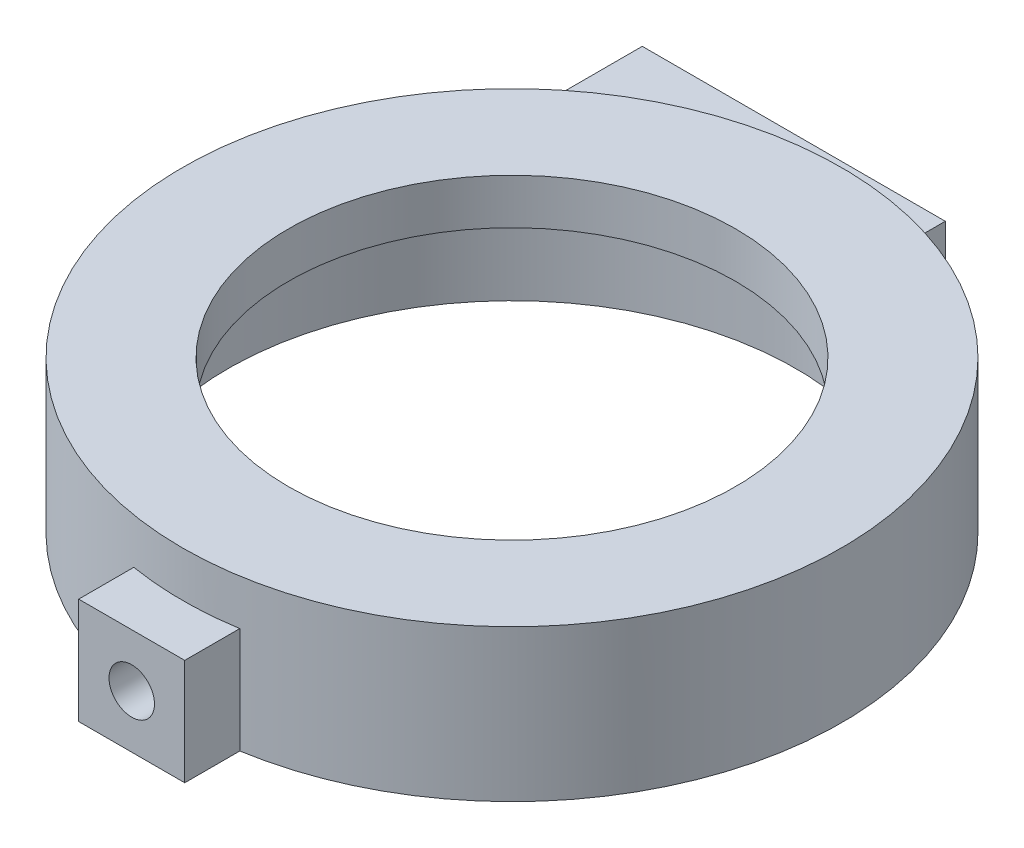
ISO-10303-21;
HEADER;
FILE_DESCRIPTION(('STEP AP214'),'2;1');
FILE_NAME('part.step','',(''),(''),'','','');
FILE_SCHEMA(('AUTOMOTIVE_DESIGN { 1 0 10303 214 1 1 1 1 }'));
ENDSEC;
DATA;
#1=APPLICATION_CONTEXT('core data for automotive mechanical design processes');
#2=APPLICATION_PROTOCOL_DEFINITION('international standard','automotive_design',2000,#1);
#3=PRODUCT_CONTEXT('',#1,'mechanical');
#4=PRODUCT('Part','Part','',(#3));
#5=PRODUCT_RELATED_PRODUCT_CATEGORY('part','',(#4));
#6=PRODUCT_DEFINITION_FORMATION('','',#4);
#7=PRODUCT_DEFINITION_CONTEXT('part definition',#1,'design');
#8=PRODUCT_DEFINITION('design','',#6,#7);
#9=PRODUCT_DEFINITION_SHAPE('','',#8);
#10=(LENGTH_UNIT() NAMED_UNIT(*) SI_UNIT(.MILLI.,.METRE.));
#11=(NAMED_UNIT(*) PLANE_ANGLE_UNIT() SI_UNIT($,.RADIAN.));
#12=(NAMED_UNIT(*) SI_UNIT($,.STERADIAN.) SOLID_ANGLE_UNIT());
#13=UNCERTAINTY_MEASURE_WITH_UNIT(LENGTH_MEASURE(1.E-05),#10,'distance_accuracy_value','');
#14=(GEOMETRIC_REPRESENTATION_CONTEXT(3) GLOBAL_UNCERTAINTY_ASSIGNED_CONTEXT((#13)) GLOBAL_UNIT_ASSIGNED_CONTEXT((#10,
#11,#12)) REPRESENTATION_CONTEXT('',''));
#15=CARTESIAN_POINT('',(0.,0.,0.));
#16=DIRECTION('',(0.,0.,1.));
#17=DIRECTION('',(1.,0.,0.));
#18=AXIS2_PLACEMENT_3D('',#15,#16,#17);
#19=CARTESIAN_POINT('',(0.,7.,0.));
#20=DIRECTION('',(0.,1.,0.));
#21=DIRECTION('',(0.,0.,1.));
#22=AXIS2_PLACEMENT_3D('',#19,#20,#21);
#23=PLANE('',#22);
#24=CARTESIAN_POINT('',(0.,7.,0.));
#25=DIRECTION('',(0.,1.,0.));
#26=DIRECTION('',(0.,0.,1.));
#27=AXIS2_PLACEMENT_3D('',#24,#25,#26);
#28=CIRCLE('',#27,21.75);
#29=CARTESIAN_POINT('',(3.5,7.,-21.4665437367081));
#30=VERTEX_POINT('',#29);
#31=CARTESIAN_POINT('',(-16.5,7.,-14.1708327207684));
#32=VERTEX_POINT('',#31);
#33=EDGE_CURVE('E12',#30,#32,#28,.T.);
#34=ORIENTED_EDGE('',*,*,#33,.F.);
#35=DIRECTION('',(0.,0.,1.));
#36=VECTOR('',#35,1.);
#37=CARTESIAN_POINT('',(3.5,7.,-25.1));
#38=LINE('',#37,#36);
#39=CARTESIAN_POINT('',(3.5,7.,-25.1));
#40=VERTEX_POINT('',#39);
#41=EDGE_CURVE('E184',#40,#30,#38,.T.);
#42=ORIENTED_EDGE('',*,*,#41,.F.);
#43=DIRECTION('',(-1.,0.,0.));
#44=VECTOR('',#43,1.);
#45=CARTESIAN_POINT('',(3.5,7.,-25.1));
#46=LINE('',#45,#44);
#47=CARTESIAN_POINT('',(-16.5,7.,-25.1));
#48=VERTEX_POINT('',#47);
#49=EDGE_CURVE('E178',#40,#48,#46,.T.);
#50=ORIENTED_EDGE('',*,*,#49,.T.);
#51=DIRECTION('',(0.,0.,-1.));
#52=VECTOR('',#51,1.);
#53=CARTESIAN_POINT('',(-16.5,7.,-25.1));
#54=LINE('',#53,#52);
#55=EDGE_CURVE('E233',#32,#48,#54,.T.);
#56=ORIENTED_EDGE('',*,*,#55,.F.);
#57=EDGE_LOOP('',(#34,#42,#50,#56));
#58=FACE_BOUND('',#57,.T.);
#59=ADVANCED_FACE('F76',(#58),#23,.T.);
#60=CARTESIAN_POINT('',(-3.5,7.,21.4665437367081));
#61=VERTEX_POINT('',#60);
#62=CARTESIAN_POINT('',(3.5,7.,21.4665437367081));
#63=VERTEX_POINT('',#62);
#64=EDGE_CURVE('E91',#61,#63,#28,.T.);
#65=ORIENTED_EDGE('',*,*,#64,.F.);
#66=DIRECTION('',(0.,0.,-1.));
#67=VECTOR('',#66,1.);
#68=CARTESIAN_POINT('',(-3.5,7.,25.1));
#69=LINE('',#68,#67);
#70=CARTESIAN_POINT('',(-3.5,7.,25.1));
#71=VERTEX_POINT('',#70);
#72=EDGE_CURVE('E155',#71,#61,#69,.T.);
#73=ORIENTED_EDGE('',*,*,#72,.F.);
#74=DIRECTION('',(-1.,0.,0.));
#75=VECTOR('',#74,1.);
#76=CARTESIAN_POINT('',(3.5,7.,25.1));
#77=LINE('',#76,#75);
#78=CARTESIAN_POINT('',(3.5,7.,25.1));
#79=VERTEX_POINT('',#78);
#80=EDGE_CURVE('E177',#79,#71,#77,.T.);
#81=ORIENTED_EDGE('',*,*,#80,.F.);
#82=DIRECTION('',(0.,0.,-1.));
#83=VECTOR('',#82,1.);
#84=CARTESIAN_POINT('',(3.5,7.,25.1));
#85=LINE('',#84,#83);
#86=EDGE_CURVE('E157',#79,#63,#85,.T.);
#87=ORIENTED_EDGE('',*,*,#86,.T.);
#88=EDGE_LOOP('',(#65,#73,#81,#87));
#89=FACE_BOUND('',#88,.T.);
#90=ADVANCED_FACE('F152',(#89),#23,.T.);
#91=CARTESIAN_POINT('',(0.,0.,0.));
#92=DIRECTION('',(0.,1.,0.));
#93=DIRECTION('',(0.,0.,1.));
#94=AXIS2_PLACEMENT_3D('',#91,#92,#93);
#95=PLANE('',#94);
#96=DIRECTION('',(0.,0.,-1.));
#97=VECTOR('',#96,1.);
#98=CARTESIAN_POINT('',(3.5,0.,25.1));
#99=LINE('',#98,#97);
#100=CARTESIAN_POINT('',(3.5,0.,25.1));
#101=VERTEX_POINT('',#100);
#102=CARTESIAN_POINT('',(3.5,0.,21.4665437367081));
#103=VERTEX_POINT('',#102);
#104=EDGE_CURVE('E188',#101,#103,#99,.T.);
#105=ORIENTED_EDGE('',*,*,#104,.F.);
#106=DIRECTION('',(-1.,0.,0.));
#107=VECTOR('',#106,1.);
#108=CARTESIAN_POINT('',(3.5,0.,25.1));
#109=LINE('',#108,#107);
#110=CARTESIAN_POINT('',(-3.5,0.,25.1));
#111=VERTEX_POINT('',#110);
#112=EDGE_CURVE('E209',#101,#111,#109,.T.);
#113=ORIENTED_EDGE('',*,*,#112,.T.);
#114=DIRECTION('',(0.,0.,-1.));
#115=VECTOR('',#114,1.);
#116=CARTESIAN_POINT('',(-3.5,0.,25.1));
#117=LINE('',#116,#115);
#118=CARTESIAN_POINT('',(-3.5,0.,21.4665437367081));
#119=VERTEX_POINT('',#118);
#120=EDGE_CURVE('E206',#111,#119,#117,.T.);
#121=ORIENTED_EDGE('',*,*,#120,.T.);
#122=CARTESIAN_POINT('',(0.,0.,0.));
#123=DIRECTION('',(0.,1.,0.));
#124=DIRECTION('',(0.,0.,1.));
#125=AXIS2_PLACEMENT_3D('',#122,#123,#124);
#126=CIRCLE('',#125,21.75);
#127=CARTESIAN_POINT('',(-16.5,0.,-14.1708327207684));
#128=VERTEX_POINT('',#127);
#129=EDGE_CURVE('E167',#128,#119,#126,.T.);
#130=ORIENTED_EDGE('',*,*,#129,.F.);
#131=DIRECTION('',(0.,0.,-1.));
#132=VECTOR('',#131,1.);
#133=CARTESIAN_POINT('',(-16.5,0.,-25.1));
#134=LINE('',#133,#132);
#135=CARTESIAN_POINT('',(-16.5,0.,-25.1));
#136=VERTEX_POINT('',#135);
#137=EDGE_CURVE('E230',#128,#136,#134,.T.);
#138=ORIENTED_EDGE('',*,*,#137,.T.);
#139=DIRECTION('',(-1.,0.,0.));
#140=VECTOR('',#139,1.);
#141=CARTESIAN_POINT('',(3.5,0.,-25.1));
#142=LINE('',#141,#140);
#143=CARTESIAN_POINT('',(3.5,0.,-25.1));
#144=VERTEX_POINT('',#143);
#145=EDGE_CURVE('E200',#144,#136,#142,.T.);
#146=ORIENTED_EDGE('',*,*,#145,.F.);
#147=DIRECTION('',(0.,0.,1.));
#148=VECTOR('',#147,1.);
#149=CARTESIAN_POINT('',(3.5,0.,-25.1));
#150=LINE('',#149,#148);
#151=CARTESIAN_POINT('',(3.5,0.,-21.4665437367081));
#152=VERTEX_POINT('',#151);
#153=EDGE_CURVE('E196',#144,#152,#150,.T.);
#154=ORIENTED_EDGE('',*,*,#153,.T.);
#155=CARTESIAN_POINT('',(0.,0.,0.));
#156=DIRECTION('',(0.,1.,0.));
#157=DIRECTION('',(0.,0.,1.));
#158=AXIS2_PLACEMENT_3D('',#155,#156,#157);
#159=CIRCLE('',#158,21.75);
#160=EDGE_CURVE('E191',#103,#152,#159,.T.);
#161=ORIENTED_EDGE('',*,*,#160,.F.);
#162=EDGE_LOOP('',(#105,#113,#121,#130,#138,#146,#154,#161));
#163=FACE_BOUND('',#162,.T.);
#164=CARTESIAN_POINT('',(0.,0.,0.));
#165=DIRECTION('',(0.,1.,0.));
#166=DIRECTION('',(0.,0.,1.));
#167=AXIS2_PLACEMENT_3D('',#164,#165,#166);
#168=CIRCLE('',#167,18.75);
#169=CARTESIAN_POINT('',(0.,0.,18.75));
#170=VERTEX_POINT('',#169);
#171=EDGE_CURVE('E192',#170,#170,#168,.T.);
#172=ORIENTED_EDGE('',*,*,#171,.T.);
#173=EDGE_LOOP('',(#172));
#174=FACE_BOUND('',#173,.T.);
#175=ADVANCED_FACE('F224',(#163,#174),#95,.F.);
#176=CARTESIAN_POINT('',(3.5,7.,25.1));
#177=DIRECTION('',(-1.,0.,0.));
#178=DIRECTION('',(0.,0.,1.));
#179=AXIS2_PLACEMENT_3D('',#176,#177,#178);
#180=PLANE('',#179);
#181=ORIENTED_EDGE('',*,*,#104,.T.);
#182=DIRECTION('',(0.,-1.,0.));
#183=VECTOR('',#182,1.);
#184=CARTESIAN_POINT('',(3.5,7.,21.4665437367081));
#185=LINE('',#184,#183);
#186=EDGE_CURVE('E161',#63,#103,#185,.T.);
#187=ORIENTED_EDGE('',*,*,#186,.F.);
#188=ORIENTED_EDGE('',*,*,#86,.F.);
#189=DIRECTION('',(0.,-1.,0.));
#190=VECTOR('',#189,1.);
#191=CARTESIAN_POINT('',(3.5,7.,25.1));
#192=LINE('',#191,#190);
#193=EDGE_CURVE('E108',#79,#101,#192,.T.);
#194=ORIENTED_EDGE('',*,*,#193,.T.);
#195=EDGE_LOOP('',(#181,#187,#188,#194));
#196=FACE_BOUND('',#195,.T.);
#197=ADVANCED_FACE('F78',(#196),#180,.F.);
#198=CARTESIAN_POINT('',(3.5,7.,-25.1));
#199=DIRECTION('',(1.,0.,0.));
#200=DIRECTION('',(0.,0.,-1.));
#201=AXIS2_PLACEMENT_3D('',#198,#199,#200);
#202=PLANE('',#201);
#203=ORIENTED_EDGE('',*,*,#153,.F.);
#204=DIRECTION('',(0.,-1.,0.));
#205=VECTOR('',#204,1.);
#206=CARTESIAN_POINT('',(3.5,7.,-25.1));
#207=LINE('',#206,#205);
#208=EDGE_CURVE('E172',#40,#144,#207,.T.);
#209=ORIENTED_EDGE('',*,*,#208,.F.);
#210=ORIENTED_EDGE('',*,*,#41,.T.);
#211=DIRECTION('',(0.,-1.,0.));
#212=VECTOR('',#211,1.);
#213=CARTESIAN_POINT('',(3.5,7.,-21.4665437367081));
#214=LINE('',#213,#212);
#215=EDGE_CURVE('E219',#30,#152,#214,.T.);
#216=ORIENTED_EDGE('',*,*,#215,.T.);
#217=EDGE_LOOP('',(#203,#209,#210,#216));
#218=FACE_BOUND('',#217,.T.);
#219=ADVANCED_FACE('F276',(#218),#202,.T.);
#220=CARTESIAN_POINT('',(3.5,7.,-25.1));
#221=DIRECTION('',(0.,0.,1.));
#222=DIRECTION('',(1.,0.,0.));
#223=AXIS2_PLACEMENT_3D('',#220,#221,#222);
#224=PLANE('',#223);
#225=CARTESIAN_POINT('',(-10.,3.5,-25.1));
#226=DIRECTION('',(0.,0.,-1.));
#227=DIRECTION('',(-1.,0.,0.));
#228=AXIS2_PLACEMENT_3D('',#225,#226,#227);
#229=CIRCLE('',#228,1.4);
#230=CARTESIAN_POINT('',(-11.4,3.5,-25.1));
#231=VERTEX_POINT('',#230);
#232=EDGE_CURVE('E245',#231,#231,#229,.T.);
#233=ORIENTED_EDGE('',*,*,#232,.F.);
#234=EDGE_LOOP('',(#233));
#235=FACE_BOUND('',#234,.T.);
#236=CARTESIAN_POINT('',(0.,3.5,-25.1));
#237=DIRECTION('',(0.,0.,-1.));
#238=DIRECTION('',(-1.,0.,0.));
#239=AXIS2_PLACEMENT_3D('',#236,#237,#238);
#240=CIRCLE('',#239,1.4);
#241=CARTESIAN_POINT('',(-1.40000000000001,3.5,-25.1));
#242=VERTEX_POINT('',#241);
#243=EDGE_CURVE('E250',#242,#242,#240,.T.);
#244=ORIENTED_EDGE('',*,*,#243,.F.);
#245=EDGE_LOOP('',(#244));
#246=FACE_BOUND('',#245,.T.);
#247=ORIENTED_EDGE('',*,*,#145,.T.);
#248=DIRECTION('',(0.,-1.,0.));
#249=VECTOR('',#248,1.);
#250=CARTESIAN_POINT('',(-16.5,7.,-25.1));
#251=LINE('',#250,#249);
#252=EDGE_CURVE('E232',#48,#136,#251,.T.);
#253=ORIENTED_EDGE('',*,*,#252,.F.);
#254=ORIENTED_EDGE('',*,*,#49,.F.);
#255=ORIENTED_EDGE('',*,*,#208,.T.);
#256=EDGE_LOOP('',(#247,#253,#254,#255));
#257=FACE_BOUND('',#256,.T.);
#258=ADVANCED_FACE('F280',(#235,#246,#257),#224,.F.);
#259=CARTESIAN_POINT('',(0.,7.,0.));
#260=DIRECTION('',(0.,-1.,0.));
#261=DIRECTION('',(0.,0.,-1.));
#262=AXIS2_PLACEMENT_3D('',#259,#260,#261);
#263=CYLINDRICAL_SURFACE('',#262,21.75);
#264=DIRECTION('',(0.,-1.,0.));
#265=VECTOR('',#264,1.);
#266=CARTESIAN_POINT('',(-3.5,7.,21.4665437367081));
#267=LINE('',#266,#265);
#268=EDGE_CURVE('E163',#61,#119,#267,.T.);
#269=ORIENTED_EDGE('',*,*,#268,.F.);
#270=ORIENTED_EDGE('',*,*,#64,.T.);
#271=ORIENTED_EDGE('',*,*,#186,.T.);
#272=ORIENTED_EDGE('',*,*,#160,.T.);
#273=ORIENTED_EDGE('',*,*,#215,.F.);
#274=ORIENTED_EDGE('',*,*,#33,.T.);
#275=DIRECTION('',(0.,-1.,0.));
#276=VECTOR('',#275,1.);
#277=CARTESIAN_POINT('',(-16.5,7.,-14.1708327207684));
#278=LINE('',#277,#276);
#279=EDGE_CURVE('E99',#32,#128,#278,.T.);
#280=ORIENTED_EDGE('',*,*,#279,.T.);
#281=ORIENTED_EDGE('',*,*,#129,.T.);
#282=EDGE_LOOP('',(#269,#270,#271,#272,#273,#274,#280,#281));
#283=FACE_BOUND('',#282,.T.);
#284=CARTESIAN_POINT('',(0.,10.,0.));
#285=DIRECTION('',(0.,1.,0.));
#286=DIRECTION('',(0.,0.,1.));
#287=AXIS2_PLACEMENT_3D('',#284,#285,#286);
#288=CIRCLE('',#287,21.75);
#289=CARTESIAN_POINT('',(0.,10.,21.75));
#290=VERTEX_POINT('',#289);
#291=EDGE_CURVE('E267',#290,#290,#288,.T.);
#292=ORIENTED_EDGE('',*,*,#291,.F.);
#293=EDGE_LOOP('',(#292));
#294=FACE_BOUND('',#293,.T.);
#295=ADVANCED_FACE('F164',(#283,#294),#263,.T.);
#296=CARTESIAN_POINT('',(-3.5,7.,25.1));
#297=DIRECTION('',(-1.,0.,0.));
#298=DIRECTION('',(0.,0.,1.));
#299=AXIS2_PLACEMENT_3D('',#296,#297,#298);
#300=PLANE('',#299);
#301=ORIENTED_EDGE('',*,*,#120,.F.);
#302=DIRECTION('',(0.,-1.,0.));
#303=VECTOR('',#302,1.);
#304=CARTESIAN_POINT('',(-3.5,7.,25.1));
#305=LINE('',#304,#303);
#306=EDGE_CURVE('E173',#71,#111,#305,.T.);
#307=ORIENTED_EDGE('',*,*,#306,.F.);
#308=ORIENTED_EDGE('',*,*,#72,.T.);
#309=ORIENTED_EDGE('',*,*,#268,.T.);
#310=EDGE_LOOP('',(#301,#307,#308,#309));
#311=FACE_BOUND('',#310,.T.);
#312=ADVANCED_FACE('F175',(#311),#300,.T.);
#313=CARTESIAN_POINT('',(3.5,7.,25.1));
#314=DIRECTION('',(0.,0.,1.));
#315=DIRECTION('',(1.,0.,0.));
#316=AXIS2_PLACEMENT_3D('',#313,#314,#315);
#317=PLANE('',#316);
#318=CARTESIAN_POINT('',(0.,3.5,25.1));
#319=DIRECTION('',(0.,0.,1.));
#320=DIRECTION('',(1.,0.,0.));
#321=AXIS2_PLACEMENT_3D('',#318,#319,#320);
#322=CIRCLE('',#321,1.5);
#323=CARTESIAN_POINT('',(1.5,3.5,25.1));
#324=VERTEX_POINT('',#323);
#325=EDGE_CURVE('E256',#324,#324,#322,.T.);
#326=ORIENTED_EDGE('',*,*,#325,.F.);
#327=EDGE_LOOP('',(#326));
#328=FACE_BOUND('',#327,.T.);
#329=ORIENTED_EDGE('',*,*,#112,.F.);
#330=ORIENTED_EDGE('',*,*,#193,.F.);
#331=ORIENTED_EDGE('',*,*,#80,.T.);
#332=ORIENTED_EDGE('',*,*,#306,.T.);
#333=EDGE_LOOP('',(#329,#330,#331,#332));
#334=FACE_BOUND('',#333,.T.);
#335=ADVANCED_FACE('F226',(#328,#334),#317,.T.);
#336=CARTESIAN_POINT('',(0.,7.,0.));
#337=DIRECTION('',(0.,-1.,0.));
#338=DIRECTION('',(0.,0.,-1.));
#339=AXIS2_PLACEMENT_3D('',#336,#337,#338);
#340=CYLINDRICAL_SURFACE('',#339,18.75);
#341=CARTESIAN_POINT('',(1.5,3.5,18.6899036915657));
#342=CARTESIAN_POINT('',(1.49999632062772,3.41588910974437,18.6899044892014));
#343=CARTESIAN_POINT('',(1.49290156215183,3.3317206652062,18.6904775942158));
#344=CARTESIAN_POINT('',(1.46470318774386,3.16571175768858,18.6927081206783));
#345=CARTESIAN_POINT('',(1.44358362109166,3.08387405616433,18.6943667767162));
#346=CARTESIAN_POINT('',(1.38794959023862,2.92495508136651,18.6985793452206));
#347=CARTESIAN_POINT('',(1.35344262614257,2.84787117282067,18.7011327563356));
#348=CARTESIAN_POINT('',(1.27202646042832,2.70060821925846,18.7068465005001));
#349=CARTESIAN_POINT('',(1.22511994393665,2.630427683824,18.7100067021084));
#350=CARTESIAN_POINT('',(1.12011551831489,2.49877819168836,18.7165863916315));
#351=CARTESIAN_POINT('',(1.06199424933048,2.43732789187484,18.7200064115608));
#352=CARTESIAN_POINT('',(0.936259445760343,2.32504341460093,18.7267155033906));
#353=CARTESIAN_POINT('',(0.868645500088394,2.27420969713547,18.7300045696121));
#354=CARTESIAN_POINT('',(0.725734168475946,2.18453992472742,18.7360861453358));
#355=CARTESIAN_POINT('',(0.650426681655086,2.14571991903267,18.738877988498));
#356=CARTESIAN_POINT('',(0.494336491088885,2.08128219450257,18.7436448358792));
#357=CARTESIAN_POINT('',(0.413553876517281,2.05566426070272,18.745619853398));
#358=CARTESIAN_POINT('',(0.248991495760869,2.01841132760336,18.7485268054688));
#359=CARTESIAN_POINT('',(0.165218575252358,2.00674626571047,18.7494609822974));
#360=CARTESIAN_POINT('',(-0.00310101422522166,1.99763728747693,18.7501885880184));
#361=CARTESIAN_POINT('',(-0.0876476697940369,2.00019312530925,18.7499820366297));
#362=CARTESIAN_POINT('',(-0.254910958845742,2.01942877416144,18.7484533122186));
#363=CARTESIAN_POINT('',(-0.337631336820587,2.03607625616637,18.7471336928186));
#364=CARTESIAN_POINT('',(-0.499099950189813,2.08297238129014,18.7435302217384));
#365=CARTESIAN_POINT('',(-0.577848150305161,2.11322114518559,18.7412463614959));
#366=CARTESIAN_POINT('',(-0.729240075628612,2.18649731782168,18.7359669873138));
#367=CARTESIAN_POINT('',(-0.801876748665349,2.22953923615441,18.7329706660993));
#368=CARTESIAN_POINT('',(-0.938906754389632,2.32716937813201,18.7266031809033));
#369=CARTESIAN_POINT('',(-1.00329993315168,2.38175781732721,18.7232320099247));
#370=CARTESIAN_POINT('',(-1.12220402922705,2.50111371219672,18.716482638835));
#371=CARTESIAN_POINT('',(-1.17668675797546,2.56590925405083,18.7131044454878));
#372=CARTESIAN_POINT('',(-1.27400569041641,2.70374207490187,18.7067312907922));
#373=CARTESIAN_POINT('',(-1.31684188556444,2.77677935994532,18.7037363297249));
#374=CARTESIAN_POINT('',(-1.38965054864154,2.92904186429338,18.6984681334495));
#375=CARTESIAN_POINT('',(-1.41962160308561,3.00826776240737,18.6961949775527));
#376=CARTESIAN_POINT('',(-1.46582859989257,3.17064933913142,18.6926292502436));
#377=CARTESIAN_POINT('',(-1.48206480809471,3.25380494164879,18.6913366598524));
#378=CARTESIAN_POINT('',(-1.50030564278629,3.4214389223715,18.6898814380755));
#379=CARTESIAN_POINT('',(-1.50234955607957,3.50591299971711,18.6897156874231));
#380=CARTESIAN_POINT('',(-1.49225064585172,3.67400262104635,18.690524676209));
#381=CARTESIAN_POINT('',(-1.48010794413208,3.75761817239478,18.6914994058556));
#382=CARTESIAN_POINT('',(-1.44201322164018,3.92150472101421,18.6944766801575));
#383=CARTESIAN_POINT('',(-1.41607949196744,4.00177999680187,18.6964778632987));
#384=CARTESIAN_POINT('',(-1.35115745890298,4.15683972413565,18.7012814234103));
#385=CARTESIAN_POINT('',(-1.31216896221481,4.23162409436024,18.7040838122436));
#386=CARTESIAN_POINT('',(-1.22214454706965,4.373759059463,18.7101815822911));
#387=CARTESIAN_POINT('',(-1.17108242281578,4.44109300986021,18.7134780300796));
#388=CARTESIAN_POINT('',(-1.05839811840015,4.5662476479122,18.7201888557784));
#389=CARTESIAN_POINT('',(-0.996775770633618,4.62406818454792,18.7236032355598));
#390=CARTESIAN_POINT('',(-0.864550602263586,4.72868853250665,18.7301744660023));
#391=CARTESIAN_POINT('',(-0.793927565253147,4.77546283652398,18.7333307098241));
#392=CARTESIAN_POINT('',(-0.645806640765806,4.85648803992158,18.7390213036078));
#393=CARTESIAN_POINT('',(-0.568308817352759,4.89073905598699,18.7415556593639));
#394=CARTESIAN_POINT('',(-0.408730022480179,4.94570151548968,18.7457141148762));
#395=CARTESIAN_POINT('',(-0.326654535286603,4.96642879824313,18.7473392791795));
#396=CARTESIAN_POINT('',(-0.160174833719194,4.99380720003187,18.7495005498768));
#397=CARTESIAN_POINT('',(-0.0757706596510529,5.00045856254326,18.7500366751083));
#398=CARTESIAN_POINT('',(0.0927188866521085,4.99949357241986,18.7499594956931));
#399=CARTESIAN_POINT('',(0.176804491059185,4.99191700058234,18.7493493958487));
#400=CARTESIAN_POINT('',(0.342505049325764,4.96279408533884,18.7470546664287));
#401=CARTESIAN_POINT('',(0.424119999621,4.94124772178048,18.7453700353031));
#402=CARTESIAN_POINT('',(0.58256563894844,4.88480677611825,18.7411153164152));
#403=CARTESIAN_POINT('',(0.6593965525984,4.8499128212543,18.7385452702617));
#404=CARTESIAN_POINT('',(0.806115934271487,4.76777187152803,18.7328074295552));
#405=CARTESIAN_POINT('',(0.8760045245382,4.72052509423304,18.7296396455302));
#406=CARTESIAN_POINT('',(1.00705879886138,4.61487049786707,18.7230514806532));
#407=CARTESIAN_POINT('',(1.06820077293534,4.55643330967203,18.7196304499822));
#408=CARTESIAN_POINT('',(1.17983224819666,4.43010829215942,18.7129268703636));
#409=CARTESIAN_POINT('',(1.23031916134281,4.36221817342083,18.709644355215));
#410=CARTESIAN_POINT('',(1.31927004620408,4.21879254913323,18.7035831840147));
#411=CARTESIAN_POINT('',(1.35771272607774,4.14324381313022,18.7008054238702));
#412=CARTESIAN_POINT('',(1.42131855200279,3.98679387767989,18.6960792751499));
#413=CARTESIAN_POINT('',(1.44649701682099,3.90589897459956,18.6941299303474));
#414=CARTESIAN_POINT('',(1.47642337958161,3.77043630193827,18.691784377361));
#415=CARTESIAN_POINT('',(1.48525291732771,3.71674059854125,18.6910823459044));
#416=CARTESIAN_POINT('',(1.49704240943925,3.60870461027899,18.6901417457999));
#417=CARTESIAN_POINT('',(1.5000023781296,3.55436432698718,18.6899031760209));
#418=CARTESIAN_POINT('',(1.5,3.5,18.6899036915657));
#419=B_SPLINE_CURVE_WITH_KNOTS('',3,(#341,#342,#343,#344,#345,#346,#347,#348,#349,#350,#351,
#352,#353,#354,#355,#356,#357,#358,#359,#360,#361,#362,#363,#364,#365,#366,#367,#368,#369,#370,
#371,#372,#373,#374,#375,#376,#377,#378,#379,#380,#381,#382,#383,#384,#385,#386,#387,#388,#389,
#390,#391,#392,#393,#394,#395,#396,#397,#398,#399,#400,#401,#402,#403,#404,#405,#406,#407,#408,
#409,#410,#411,#412,#413,#414,#415,#416,#417,#418),.UNSPECIFIED.,.T.,.F.,(4,2,2,2,2,2,2,2,2,2,2,
2,2,2,2,2,2,2,2,2,2,2,2,2,2,2,2,2,2,2,2,2,2,2,2,2,2,2,4),(0.,0.25213418203791,0.50455561402385,
0.756835834120728,1.00906146755583,1.26181826116902,1.51458600394927,1.7676899785965,
2.02078983191417,2.27334337309686,2.52589254857181,2.77786389180794,3.02983747254223,
3.28209793140011,3.53436309986935,3.78733494058949,4.0403069669025,4.29330677998519,
4.54630169612057,4.79859599700462,5.05088813179099,5.30284648195618,5.55480856292754,
5.80732263043169,6.05984070604075,6.31293630132195,6.56602953833693,6.8188258119051,
7.07161771273227,7.32370386856552,7.5757903880512,7.82786506275495,8.07993529802616,
8.33267638790938,8.5854787963961,8.83872562068804,9.09167932690653,9.25464441416333,
9.41760910369755),.UNSPECIFIED.);
#420=CARTESIAN_POINT('',(1.5,3.5,18.6899036915657));
#421=VERTEX_POINT('',#420);
#422=EDGE_CURVE('E80',#421,#421,#419,.T.);
#423=ORIENTED_EDGE('',*,*,#422,.F.);
#424=EDGE_LOOP('',(#423));
#425=FACE_BOUND('',#424,.T.);
#426=CARTESIAN_POINT('',(0.,7.,0.));
#427=DIRECTION('',(0.,1.,0.));
#428=DIRECTION('',(0.,0.,1.));
#429=AXIS2_PLACEMENT_3D('',#426,#427,#428);
#430=CIRCLE('',#429,18.75);
#431=CARTESIAN_POINT('',(0.,7.,18.75));
#432=VERTEX_POINT('',#431);
#433=EDGE_CURVE('E263',#432,#432,#430,.T.);
#434=ORIENTED_EDGE('',*,*,#433,.T.);
#435=EDGE_LOOP('',(#434));
#436=FACE_BOUND('',#435,.T.);
#437=ORIENTED_EDGE('',*,*,#171,.F.);
#438=EDGE_LOOP('',(#437));
#439=FACE_BOUND('',#438,.T.);
#440=ADVANCED_FACE('F297',(#425,#436,#439),#340,.F.);
#441=CARTESIAN_POINT('',(0.,3.5,18.1));
#442=DIRECTION('',(0.,0.,1.));
#443=DIRECTION('',(1.,0.,0.));
#444=AXIS2_PLACEMENT_3D('',#441,#442,#443);
#445=CYLINDRICAL_SURFACE('',#444,1.5);
#446=ORIENTED_EDGE('',*,*,#422,.T.);
#447=EDGE_LOOP('',(#446));
#448=FACE_BOUND('',#447,.T.);
#449=ORIENTED_EDGE('',*,*,#325,.T.);
#450=EDGE_LOOP('',(#449));
#451=FACE_BOUND('',#450,.T.);
#452=ADVANCED_FACE('F321',(#448,#451),#445,.F.);
#453=CARTESIAN_POINT('',(0.,3.5,-20.1));
#454=DIRECTION('',(0.,0.,-1.));
#455=DIRECTION('',(-1.,0.,0.));
#456=AXIS2_PLACEMENT_3D('',#453,#454,#455);
#457=CYLINDRICAL_SURFACE('',#456,1.4);
#458=CARTESIAN_POINT('',(0.,3.5,-20.1));
#459=DIRECTION('',(0.,0.,-1.));
#460=DIRECTION('',(-1.,0.,0.));
#461=AXIS2_PLACEMENT_3D('',#458,#459,#460);
#462=CIRCLE('',#461,1.4);
#463=CARTESIAN_POINT('',(-1.4,3.5,-20.1));
#464=VERTEX_POINT('',#463);
#465=EDGE_CURVE('E252',#464,#464,#462,.T.);
#466=ORIENTED_EDGE('',*,*,#465,.F.);
#467=EDGE_LOOP('',(#466));
#468=FACE_BOUND('',#467,.T.);
#469=ORIENTED_EDGE('',*,*,#243,.T.);
#470=EDGE_LOOP('',(#469));
#471=FACE_BOUND('',#470,.T.);
#472=ADVANCED_FACE('F328',(#468,#471),#457,.F.);
#473=CARTESIAN_POINT('',(0.,3.5,-20.1));
#474=DIRECTION('',(0.,0.,-1.));
#475=DIRECTION('',(-1.,0.,0.));
#476=AXIS2_PLACEMENT_3D('',#473,#474,#475);
#477=PLANE('',#476);
#478=ORIENTED_EDGE('',*,*,#465,.T.);
#479=EDGE_LOOP('',(#478));
#480=FACE_BOUND('',#479,.T.);
#481=ADVANCED_FACE('F335',(#480),#477,.T.);
#482=CARTESIAN_POINT('',(-16.5,7.,-25.1));
#483=DIRECTION('',(-1.,0.,0.));
#484=DIRECTION('',(0.,0.,1.));
#485=AXIS2_PLACEMENT_3D('',#482,#483,#484);
#486=PLANE('',#485);
#487=ORIENTED_EDGE('',*,*,#137,.F.);
#488=ORIENTED_EDGE('',*,*,#279,.F.);
#489=ORIENTED_EDGE('',*,*,#55,.T.);
#490=ORIENTED_EDGE('',*,*,#252,.T.);
#491=EDGE_LOOP('',(#487,#488,#489,#490));
#492=FACE_BOUND('',#491,.T.);
#493=ADVANCED_FACE('F236',(#492),#486,.T.);
#494=CARTESIAN_POINT('',(-10.,3.5,-18.1));
#495=DIRECTION('',(0.,0.,-1.));
#496=DIRECTION('',(-1.,0.,0.));
#497=AXIS2_PLACEMENT_3D('',#494,#495,#496);
#498=CYLINDRICAL_SURFACE('',#497,1.4);
#499=CARTESIAN_POINT('',(-10.,3.5,-18.1));
#500=DIRECTION('',(0.,0.,-1.));
#501=DIRECTION('',(-1.,0.,0.));
#502=AXIS2_PLACEMENT_3D('',#499,#500,#501);
#503=CIRCLE('',#502,1.4);
#504=CARTESIAN_POINT('',(-11.4,3.5,-18.1));
#505=VERTEX_POINT('',#504);
#506=EDGE_CURVE('E239',#505,#505,#503,.T.);
#507=ORIENTED_EDGE('',*,*,#506,.F.);
#508=EDGE_LOOP('',(#507));
#509=FACE_BOUND('',#508,.T.);
#510=ORIENTED_EDGE('',*,*,#232,.T.);
#511=EDGE_LOOP('',(#510));
#512=FACE_BOUND('',#511,.T.);
#513=ADVANCED_FACE('F350',(#509,#512),#498,.F.);
#514=CARTESIAN_POINT('',(-10.,3.5,-18.1));
#515=DIRECTION('',(0.,0.,-1.));
#516=DIRECTION('',(-1.,0.,0.));
#517=AXIS2_PLACEMENT_3D('',#514,#515,#516);
#518=PLANE('',#517);
#519=ORIENTED_EDGE('',*,*,#506,.T.);
#520=EDGE_LOOP('',(#519));
#521=FACE_BOUND('',#520,.T.);
#522=ADVANCED_FACE('F358',(#521),#518,.T.);
#523=CARTESIAN_POINT('',(0.,10.,0.));
#524=DIRECTION('',(0.,1.,0.));
#525=DIRECTION('',(0.,0.,1.));
#526=AXIS2_PLACEMENT_3D('',#523,#524,#525);
#527=PLANE('',#526);
#528=ORIENTED_EDGE('',*,*,#291,.T.);
#529=EDGE_LOOP('',(#528));
#530=FACE_BOUND('',#529,.T.);
#531=CARTESIAN_POINT('',(0.,10.,0.));
#532=DIRECTION('',(0.,1.,0.));
#533=DIRECTION('',(0.,0.,1.));
#534=AXIS2_PLACEMENT_3D('',#531,#532,#533);
#535=CIRCLE('',#534,14.75);
#536=CARTESIAN_POINT('',(0.,10.,14.75));
#537=VERTEX_POINT('',#536);
#538=EDGE_CURVE('E511',#537,#537,#535,.T.);
#539=ORIENTED_EDGE('',*,*,#538,.F.);
#540=EDGE_LOOP('',(#539));
#541=FACE_BOUND('',#540,.T.);
#542=ADVANCED_FACE('F366',(#530,#541),#527,.T.);
#543=CARTESIAN_POINT('',(0.,7.,0.));
#544=DIRECTION('',(0.,1.,0.));
#545=DIRECTION('',(0.,0.,1.));
#546=AXIS2_PLACEMENT_3D('',#543,#544,#545);
#547=PLANE('',#546);
#548=ORIENTED_EDGE('',*,*,#433,.F.);
#549=EDGE_LOOP('',(#548));
#550=FACE_BOUND('',#549,.T.);
#551=CARTESIAN_POINT('',(0.,7.,0.));
#552=DIRECTION('',(0.,1.,0.));
#553=DIRECTION('',(0.,0.,1.));
#554=AXIS2_PLACEMENT_3D('',#551,#552,#553);
#555=CIRCLE('',#554,14.75);
#556=CARTESIAN_POINT('',(0.,7.,14.75));
#557=VERTEX_POINT('',#556);
#558=EDGE_CURVE('E514',#557,#557,#555,.T.);
#559=ORIENTED_EDGE('',*,*,#558,.T.);
#560=EDGE_LOOP('',(#559));
#561=FACE_BOUND('',#560,.T.);
#562=ADVANCED_FACE('F373',(#550,#561),#547,.F.);
#563=CARTESIAN_POINT('',(0.,10.,0.));
#564=DIRECTION('',(0.,-1.,0.));
#565=DIRECTION('',(0.,0.,-1.));
#566=AXIS2_PLACEMENT_3D('',#563,#564,#565);
#567=CYLINDRICAL_SURFACE('',#566,14.75);
#568=ORIENTED_EDGE('',*,*,#538,.T.);
#569=EDGE_LOOP('',(#568));
#570=FACE_BOUND('',#569,.T.);
#571=ORIENTED_EDGE('',*,*,#558,.F.);
#572=EDGE_LOOP('',(#571));
#573=FACE_BOUND('',#572,.T.);
#574=ADVANCED_FACE('F381',(#570,#573),#567,.F.);
#575=CLOSED_SHELL('',(#59,#90,#175,#197,#219,#258,#295,#312,#335,#440,#452,#472,#481,#493,#513,
#522,#542,#562,#574));
#576=MANIFOLD_SOLID_BREP('B2',#575);
#577=ADVANCED_BREP_SHAPE_REPRESENTATION('',(#18,#576),#14);
#578=SHAPE_DEFINITION_REPRESENTATION(#9,#577);
ENDSEC;
END-ISO-10303-21;
